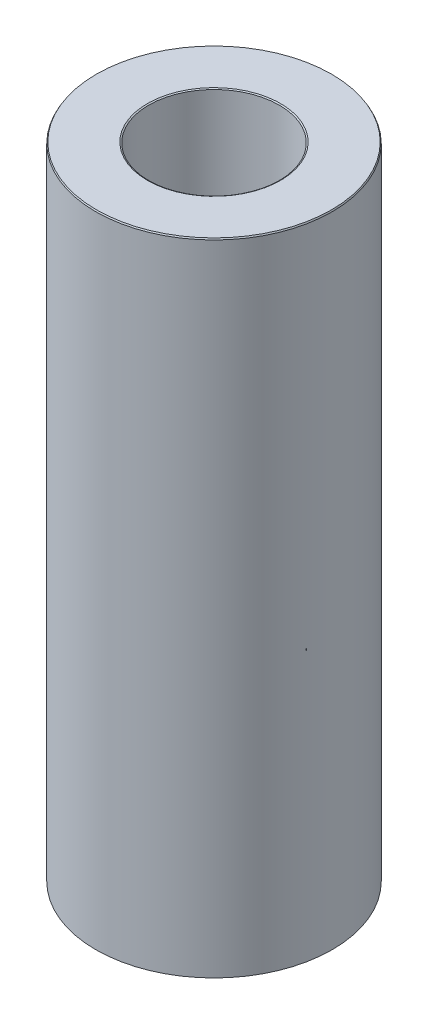
ISO-10303-21;
HEADER;
FILE_DESCRIPTION(('STEP AP214'),'2;1');
FILE_NAME('part.step','',(''),(''),'','','');
FILE_SCHEMA(('AUTOMOTIVE_DESIGN { 1 0 10303 214 1 1 1 1 }'));
ENDSEC;
DATA;
#1=APPLICATION_CONTEXT('core data for automotive mechanical design processes');
#2=APPLICATION_PROTOCOL_DEFINITION('international standard','automotive_design',2000,#1);
#3=PRODUCT_CONTEXT('',#1,'mechanical');
#4=PRODUCT('Part','Part','',(#3));
#5=PRODUCT_RELATED_PRODUCT_CATEGORY('part','',(#4));
#6=PRODUCT_DEFINITION_FORMATION('','',#4);
#7=PRODUCT_DEFINITION_CONTEXT('part definition',#1,'design');
#8=PRODUCT_DEFINITION('design','',#6,#7);
#9=PRODUCT_DEFINITION_SHAPE('','',#8);
#10=(LENGTH_UNIT() NAMED_UNIT(*) SI_UNIT(.MILLI.,.METRE.));
#11=(NAMED_UNIT(*) PLANE_ANGLE_UNIT() SI_UNIT($,.RADIAN.));
#12=(NAMED_UNIT(*) SI_UNIT($,.STERADIAN.) SOLID_ANGLE_UNIT());
#13=UNCERTAINTY_MEASURE_WITH_UNIT(LENGTH_MEASURE(1.E-05),#10,'distance_accuracy_value','');
#14=(GEOMETRIC_REPRESENTATION_CONTEXT(3) GLOBAL_UNCERTAINTY_ASSIGNED_CONTEXT((#13)) GLOBAL_UNIT_ASSIGNED_CONTEXT((#10,
#11,#12)) REPRESENTATION_CONTEXT('',''));
#15=CARTESIAN_POINT('',(0.,0.,0.));
#16=DIRECTION('',(0.,0.,1.));
#17=DIRECTION('',(1.,0.,0.));
#18=AXIS2_PLACEMENT_3D('',#15,#16,#17);
#19=CARTESIAN_POINT('',(0.,325.263457723034,0.));
#20=DIRECTION('',(0.,-1.,0.));
#21=DIRECTION('',(0.,0.,-1.));
#22=AXIS2_PLACEMENT_3D('',#19,#20,#21);
#23=CYLINDRICAL_SURFACE('',#22,60.);
#24=CARTESIAN_POINT('',(0.,0.372663856759436,0.));
#25=DIRECTION('',(0.,1.,0.));
#26=DIRECTION('',(0.,0.,1.));
#27=AXIS2_PLACEMENT_3D('',#24,#25,#26);
#28=CIRCLE('',#27,60.);
#29=CARTESIAN_POINT('',(0.,0.372663856759381,-60.));
#30=VERTEX_POINT('',#29);
#31=EDGE_CURVE('E10',#30,#30,#28,.T.);
#32=CARTESIAN_POINT('',(0.,324.617984988983,0.));
#33=DIRECTION('',(0.,1.,0.));
#34=DIRECTION('',(0.,0.,1.));
#35=AXIS2_PLACEMENT_3D('',#32,#33,#34);
#36=CIRCLE('',#35,60.);
#37=CARTESIAN_POINT('',(0.,324.617984988982,-60.));
#38=VERTEX_POINT('',#37);
#39=EDGE_CURVE('E50',#38,#38,#36,.F.);
#40=CARTESIAN_POINT('',(0.,0.372663856759381,-60.));
#41=CARTESIAN_POINT('',(0.,3.75021928522003,-60.));
#42=CARTESIAN_POINT('',(0.,7.12777471368068,-60.));
#43=CARTESIAN_POINT('',(0.,13.882885570602,-60.));
#44=CARTESIAN_POINT('',(0.,17.2604409990627,-60.));
#45=CARTESIAN_POINT('',(0.,24.015551855984,-60.));
#46=CARTESIAN_POINT('',(0.,27.3931072844446,-60.));
#47=CARTESIAN_POINT('',(0.,34.148218141366,-60.));
#48=CARTESIAN_POINT('',(0.,37.5257735698266,-60.));
#49=CARTESIAN_POINT('',(0.,44.280884426748,-60.));
#50=CARTESIAN_POINT('',(0.,47.6584398552086,-60.));
#51=CARTESIAN_POINT('',(0.,54.4135507121299,-60.));
#52=CARTESIAN_POINT('',(0.,57.7911061405906,-60.));
#53=CARTESIAN_POINT('',(0.,64.5462169975119,-60.));
#54=CARTESIAN_POINT('',(0.,67.9237724259725,-60.));
#55=CARTESIAN_POINT('',(0.,74.6788832828939,-60.));
#56=CARTESIAN_POINT('',(0.,78.0564387113545,-60.));
#57=CARTESIAN_POINT('',(0.,84.8115495682758,-60.));
#58=CARTESIAN_POINT('',(0.,88.1891049967365,-60.));
#59=CARTESIAN_POINT('',(0.,94.9442158536578,-60.));
#60=CARTESIAN_POINT('',(0.,98.3217712821184,-60.));
#61=CARTESIAN_POINT('',(0.,105.07688213904,-60.));
#62=CARTESIAN_POINT('',(0.,108.4544375675,-60.));
#63=CARTESIAN_POINT('',(0.,115.209548424422,-60.));
#64=CARTESIAN_POINT('',(0.,118.587103852882,-60.));
#65=CARTESIAN_POINT('',(0.,125.342214709804,-60.));
#66=CARTESIAN_POINT('',(0.,128.719770138264,-60.));
#67=CARTESIAN_POINT('',(0.,135.474880995186,-60.));
#68=CARTESIAN_POINT('',(0.,138.852436423646,-60.));
#69=CARTESIAN_POINT('',(0.,145.607547280568,-60.));
#70=CARTESIAN_POINT('',(0.,148.985102709028,-60.));
#71=CARTESIAN_POINT('',(0.,155.74021356595,-60.));
#72=CARTESIAN_POINT('',(0.,159.11776899441,-60.));
#73=CARTESIAN_POINT('',(0.,165.872879851332,-60.));
#74=CARTESIAN_POINT('',(0.,169.250435279792,-60.));
#75=CARTESIAN_POINT('',(0.,176.005546136714,-60.));
#76=CARTESIAN_POINT('',(0.,179.383101565174,-60.));
#77=CARTESIAN_POINT('',(0.,186.138212422096,-60.));
#78=CARTESIAN_POINT('',(0.,189.515767850556,-60.));
#79=CARTESIAN_POINT('',(0.,196.270878707477,-60.));
#80=CARTESIAN_POINT('',(0.,199.648434135938,-60.));
#81=CARTESIAN_POINT('',(0.,206.403544992859,-60.));
#82=CARTESIAN_POINT('',(0.,209.78110042132,-60.));
#83=CARTESIAN_POINT('',(0.,216.536211278241,-60.));
#84=CARTESIAN_POINT('',(0.,219.913766706702,-60.));
#85=CARTESIAN_POINT('',(0.,226.668877563623,-60.));
#86=CARTESIAN_POINT('',(0.,230.046432992084,-60.));
#87=CARTESIAN_POINT('',(0.,236.801543849005,-60.));
#88=CARTESIAN_POINT('',(0.,240.179099277466,-60.));
#89=CARTESIAN_POINT('',(0.,246.934210134387,-60.));
#90=CARTESIAN_POINT('',(0.,250.311765562848,-60.));
#91=CARTESIAN_POINT('',(0.,257.066876419769,-60.));
#92=CARTESIAN_POINT('',(0.,260.44443184823,-60.));
#93=CARTESIAN_POINT('',(0.,267.199542705151,-60.));
#94=CARTESIAN_POINT('',(0.,270.577098133612,-60.));
#95=CARTESIAN_POINT('',(0.,277.332208990533,-60.));
#96=CARTESIAN_POINT('',(0.,280.709764418994,-60.));
#97=CARTESIAN_POINT('',(0.,287.464875275915,-60.));
#98=CARTESIAN_POINT('',(0.,290.842430704376,-60.));
#99=CARTESIAN_POINT('',(0.,297.597541561297,-60.));
#100=CARTESIAN_POINT('',(0.,300.975096989758,-60.));
#101=CARTESIAN_POINT('',(0.,307.730207846679,-60.));
#102=CARTESIAN_POINT('',(0.,311.10776327514,-60.));
#103=CARTESIAN_POINT('',(0.,317.862874132061,-60.));
#104=CARTESIAN_POINT('',(0.,321.240429560522,-60.));
#105=CARTESIAN_POINT('',(0.,324.617984988982,-60.));
#106=B_SPLINE_CURVE_WITH_KNOTS('',3,(#40,#41,#42,#43,#44,#45,#46,#47,#48,#49,#50,#51,#52,#53,
#54,#55,#56,#57,#58,#59,#60,#61,#62,#63,#64,#65,#66,#67,#68,#69,#70,#71,#72,#73,#74,#75,#76,#77,
#78,#79,#80,#81,#82,#83,#84,#85,#86,#87,#88,#89,#90,#91,#92,#93,#94,#95,#96,#97,#98,#99,#100,
#101,#102,#103,#104,#105),.UNSPECIFIED.,.F.,.F.,(4,2,2,2,2,2,2,2,2,2,2,2,2,2,2,2,2,2,2,2,2,2,2,
2,2,2,2,2,2,2,2,2,4),(0.,10.132666285382,20.265332570764,30.3979988561459,40.5306651415279,
50.6633314269099,60.7959977122918,70.9286639976738,81.0613302830558,91.1939965684377,
101.32666285382,111.459329139202,121.591995424584,131.724661709966,141.857327995348,
151.98999428073,162.122660566112,172.255326851494,182.387993136876,192.520659422257,
202.653325707639,212.785991993021,222.918658278403,233.051324563785,243.183990849167,
253.316657134549,263.449323419931,273.581989705313,283.714655990695,293.847322276077,
303.979988561459,314.112654846841,324.245321132223),.UNSPECIFIED.);
#107=EDGE_CURVE('BSEAM39',#30,#38,#106,.T.);
#108=ORIENTED_EDGE('',*,*,#31,.T.);
#109=ORIENTED_EDGE('',*,*,#39,.T.);
#110=ORIENTED_EDGE('',*,*,#107,.T.);
#111=ORIENTED_EDGE('',*,*,#107,.F.);
#112=EDGE_LOOP('',(#108,#110,#109,#111));
#113=FACE_BOUND('',#112,.T.);
#114=ADVANCED_FACE('F39',(#113),#23,.T.);
#115=CARTESIAN_POINT('',(0.,325.263457723034,0.));
#116=DIRECTION('',(0.,1.,0.));
#117=DIRECTION('',(0.,0.,1.));
#118=AXIS2_PLACEMENT_3D('',#115,#116,#117);
#119=PLANE('',#118);
#120=CARTESIAN_POINT('',(0.,325.263457723034,0.));
#121=DIRECTION('',(0.,1.,0.));
#122=DIRECTION('',(0.,0.,1.));
#123=AXIS2_PLACEMENT_3D('',#120,#121,#122);
#124=CIRCLE('',#123,33.7817606473295);
#125=CARTESIAN_POINT('',(0.,325.263457723034,33.7817606473295));
#126=VERTEX_POINT('',#125);
#127=EDGE_CURVE('E58',#126,#126,#124,.F.);
#128=ORIENTED_EDGE('',*,*,#127,.T.);
#129=EDGE_LOOP('',(#128));
#130=FACE_BOUND('',#129,.T.);
#131=CARTESIAN_POINT('',(0.,325.263457723034,0.));
#132=DIRECTION('',(0.,1.,0.));
#133=DIRECTION('',(0.,0.,1.));
#134=AXIS2_PLACEMENT_3D('',#131,#132,#133);
#135=CIRCLE('',#134,59.6273361432409);
#136=CARTESIAN_POINT('',(0.,325.263457723034,59.6273361432409));
#137=VERTEX_POINT('',#136);
#138=EDGE_CURVE('E61',#137,#137,#135,.T.);
#139=ORIENTED_EDGE('',*,*,#138,.T.);
#140=EDGE_LOOP('',(#139));
#141=FACE_BOUND('',#140,.T.);
#142=ADVANCED_FACE('F88',(#130,#141),#119,.T.);
#143=CARTESIAN_POINT('',(0.,0.,0.));
#144=DIRECTION('',(0.,1.,0.));
#145=DIRECTION('',(0.,0.,1.));
#146=AXIS2_PLACEMENT_3D('',#143,#144,#145);
#147=PLANE('',#146);
#148=CARTESIAN_POINT('',(0.,0.,0.));
#149=DIRECTION('',(0.,1.,0.));
#150=DIRECTION('',(0.,0.,1.));
#151=AXIS2_PLACEMENT_3D('',#148,#149,#150);
#152=CIRCLE('',#151,33.5089517700369);
#153=CARTESIAN_POINT('',(0.,0.,33.5089517700369));
#154=VERTEX_POINT('',#153);
#155=EDGE_CURVE('E51',#154,#154,#152,.T.);
#156=ORIENTED_EDGE('',*,*,#155,.T.);
#157=EDGE_LOOP('',(#156));
#158=FACE_BOUND('',#157,.T.);
#159=CARTESIAN_POINT('',(0.,0.,0.));
#160=DIRECTION('',(0.,1.,0.));
#161=DIRECTION('',(0.,0.,1.));
#162=AXIS2_PLACEMENT_3D('',#159,#160,#161);
#163=CIRCLE('',#162,59.354527265948);
#164=CARTESIAN_POINT('',(0.,0.,59.354527265948));
#165=VERTEX_POINT('',#164);
#166=EDGE_CURVE('E54',#165,#165,#163,.F.);
#167=ORIENTED_EDGE('',*,*,#166,.T.);
#168=EDGE_LOOP('',(#167));
#169=FACE_BOUND('',#168,.T.);
#170=ADVANCED_FACE('F83',(#158,#169),#147,.F.);
#171=CARTESIAN_POINT('',(0.,325.263457723034,0.));
#172=DIRECTION('',(0.,-1.,0.));
#173=DIRECTION('',(0.,0.,-1.));
#174=AXIS2_PLACEMENT_3D('',#171,#172,#173);
#175=CYLINDRICAL_SURFACE('',#174,33.1362879132775);
#176=CARTESIAN_POINT('',(0.,324.890793866275,0.));
#177=DIRECTION('',(0.,1.,0.));
#178=DIRECTION('',(0.,0.,1.));
#179=AXIS2_PLACEMENT_3D('',#176,#177,#178);
#180=CIRCLE('',#179,33.1362879132775);
#181=CARTESIAN_POINT('',(0.,324.890793866274,-33.1362879132775));
#182=VERTEX_POINT('',#181);
#183=EDGE_CURVE('E67',#182,#182,#180,.T.);
#184=CARTESIAN_POINT('',(0.,0.645472734051855,0.));
#185=DIRECTION('',(0.,1.,0.));
#186=DIRECTION('',(0.,0.,1.));
#187=AXIS2_PLACEMENT_3D('',#184,#185,#186);
#188=CIRCLE('',#187,33.1362879132775);
#189=CARTESIAN_POINT('',(0.,0.6454727340518,-33.1362879132775));
#190=VERTEX_POINT('',#189);
#191=EDGE_CURVE('E69',#190,#190,#188,.F.);
#192=CARTESIAN_POINT('',(0.,324.890793866274,-33.1362879132775));
#193=CARTESIAN_POINT('',(0.,321.513238437814,-33.1362879132775));
#194=CARTESIAN_POINT('',(0.,318.135683009353,-33.1362879132775));
#195=CARTESIAN_POINT('',(0.,311.380572152432,-33.1362879132775));
#196=CARTESIAN_POINT('',(0.,308.003016723971,-33.1362879132775));
#197=CARTESIAN_POINT('',(0.,301.24790586705,-33.1362879132775));
#198=CARTESIAN_POINT('',(0.,297.870350438589,-33.1362879132775));
#199=CARTESIAN_POINT('',(0.,291.115239581668,-33.1362879132775));
#200=CARTESIAN_POINT('',(0.,287.737684153207,-33.1362879132775));
#201=CARTESIAN_POINT('',(0.,280.982573296286,-33.1362879132775));
#202=CARTESIAN_POINT('',(0.,277.605017867825,-33.1362879132775));
#203=CARTESIAN_POINT('',(0.,270.849907010904,-33.1362879132775));
#204=CARTESIAN_POINT('',(0.,267.472351582443,-33.1362879132775));
#205=CARTESIAN_POINT('',(0.,260.717240725522,-33.1362879132775));
#206=CARTESIAN_POINT('',(0.,257.339685297061,-33.1362879132775));
#207=CARTESIAN_POINT('',(0.,250.58457444014,-33.1362879132775));
#208=CARTESIAN_POINT('',(0.,247.207019011679,-33.1362879132775));
#209=CARTESIAN_POINT('',(0.,240.451908154758,-33.1362879132775));
#210=CARTESIAN_POINT('',(0.,237.074352726298,-33.1362879132775));
#211=CARTESIAN_POINT('',(0.,230.319241869376,-33.1362879132775));
#212=CARTESIAN_POINT('',(0.,226.941686440916,-33.1362879132775));
#213=CARTESIAN_POINT('',(0.,220.186575583994,-33.1362879132775));
#214=CARTESIAN_POINT('',(0.,216.809020155534,-33.1362879132775));
#215=CARTESIAN_POINT('',(0.,210.053909298612,-33.1362879132775));
#216=CARTESIAN_POINT('',(0.,206.676353870152,-33.1362879132775));
#217=CARTESIAN_POINT('',(0.,199.92124301323,-33.1362879132775));
#218=CARTESIAN_POINT('',(0.,196.54368758477,-33.1362879132775));
#219=CARTESIAN_POINT('',(0.,189.788576727848,-33.1362879132775));
#220=CARTESIAN_POINT('',(0.,186.411021299388,-33.1362879132775));
#221=CARTESIAN_POINT('',(0.,179.655910442466,-33.1362879132775));
#222=CARTESIAN_POINT('',(0.,176.278355014006,-33.1362879132775));
#223=CARTESIAN_POINT('',(0.,169.523244157084,-33.1362879132775));
#224=CARTESIAN_POINT('',(0.,166.145688728624,-33.1362879132775));
#225=CARTESIAN_POINT('',(0.,159.390577871703,-33.1362879132775));
#226=CARTESIAN_POINT('',(0.,156.013022443242,-33.1362879132775));
#227=CARTESIAN_POINT('',(0.,149.257911586321,-33.1362879132775));
#228=CARTESIAN_POINT('',(0.,145.88035615786,-33.1362879132775));
#229=CARTESIAN_POINT('',(0.,139.125245300939,-33.1362879132775));
#230=CARTESIAN_POINT('',(0.,135.747689872478,-33.1362879132775));
#231=CARTESIAN_POINT('',(0.,128.992579015557,-33.1362879132775));
#232=CARTESIAN_POINT('',(0.,125.615023587096,-33.1362879132775));
#233=CARTESIAN_POINT('',(0.,118.859912730175,-33.1362879132775));
#234=CARTESIAN_POINT('',(0.,115.482357301714,-33.1362879132775));
#235=CARTESIAN_POINT('',(0.,108.727246444793,-33.1362879132775));
#236=CARTESIAN_POINT('',(0.,105.349691016332,-33.1362879132775));
#237=CARTESIAN_POINT('',(0.,98.5945801594107,-33.1362879132775));
#238=CARTESIAN_POINT('',(0.,95.2170247309501,-33.1362879132775));
#239=CARTESIAN_POINT('',(0.,88.4619138740288,-33.1362879132775));
#240=CARTESIAN_POINT('',(0.,85.0843584455681,-33.1362879132775));
#241=CARTESIAN_POINT('',(0.,78.3292475886468,-33.1362879132775));
#242=CARTESIAN_POINT('',(0.,74.9516921601862,-33.1362879132775));
#243=CARTESIAN_POINT('',(0.,68.1965813032649,-33.1362879132775));
#244=CARTESIAN_POINT('',(0.,64.8190258748042,-33.1362879132775));
#245=CARTESIAN_POINT('',(0.,58.0639150178829,-33.1362879132775));
#246=CARTESIAN_POINT('',(0.,54.6863595894223,-33.1362879132775));
#247=CARTESIAN_POINT('',(0.,47.931248732501,-33.1362879132775));
#248=CARTESIAN_POINT('',(0.,44.5536933040403,-33.1362879132775));
#249=CARTESIAN_POINT('',(0.,37.798582447119,-33.1362879132775));
#250=CARTESIAN_POINT('',(0.,34.4210270186583,-33.1362879132775));
#251=CARTESIAN_POINT('',(0.,27.665916161737,-33.1362879132775));
#252=CARTESIAN_POINT('',(0.,24.2883607332764,-33.1362879132775));
#253=CARTESIAN_POINT('',(0.,17.5332498763551,-33.1362879132775));
#254=CARTESIAN_POINT('',(0.,14.1556944478944,-33.1362879132775));
#255=CARTESIAN_POINT('',(0.,7.4005835909731,-33.1362879132775));
#256=CARTESIAN_POINT('',(0.,4.02302816251245,-33.1362879132775));
#257=CARTESIAN_POINT('',(0.,0.6454727340518,-33.1362879132775));
#258=B_SPLINE_CURVE_WITH_KNOTS('',3,(#192,#193,#194,#195,#196,#197,#198,#199,#200,#201,#202,
#203,#204,#205,#206,#207,#208,#209,#210,#211,#212,#213,#214,#215,#216,#217,#218,#219,#220,#221,
#222,#223,#224,#225,#226,#227,#228,#229,#230,#231,#232,#233,#234,#235,#236,#237,#238,#239,#240,
#241,#242,#243,#244,#245,#246,#247,#248,#249,#250,#251,#252,#253,#254,#255,#256,#257),
.UNSPECIFIED.,.F.,.F.,(4,2,2,2,2,2,2,2,2,2,2,2,2,2,2,2,2,2,2,2,2,2,2,2,2,2,2,2,2,2,2,2,4),(0.,
10.132666285382,20.2653325707639,30.3979988561459,40.5306651415278,50.6633314269098,
60.7959977122917,70.9286639976737,81.0613302830556,91.1939965684376,101.32666285382,
111.459329139202,121.591995424583,131.724661709965,141.857327995347,151.989994280729,
162.122660566111,172.255326851493,182.387993136875,192.520659422257,202.653325707639,
212.785991993021,222.918658278403,233.051324563785,243.183990849167,253.316657134549,
263.449323419931,273.581989705313,283.714655990695,293.847322276077,303.979988561459,
314.112654846841,324.245321132223),.UNSPECIFIED.);
#259=EDGE_CURVE('BSEAM71',#182,#190,#258,.T.);
#260=ORIENTED_EDGE('',*,*,#183,.T.);
#261=ORIENTED_EDGE('',*,*,#191,.T.);
#262=ORIENTED_EDGE('',*,*,#259,.T.);
#263=ORIENTED_EDGE('',*,*,#259,.F.);
#264=EDGE_LOOP('',(#260,#262,#261,#263));
#265=FACE_BOUND('',#264,.T.);
#266=ADVANCED_FACE('F71',(#265),#175,.F.);
#267=CARTESIAN_POINT('',(0.,324.890793866275,0.));
#268=DIRECTION('',(0.,1.,0.));
#269=DIRECTION('',(0.,0.,1.));
#270=AXIS2_PLACEMENT_3D('',#267,#268,#269);
#271=CONICAL_SURFACE('',#270,33.1362879132775,1.04719755119662);
#272=ORIENTED_EDGE('',*,*,#127,.F.);
#273=EDGE_LOOP('',(#272));
#274=FACE_BOUND('',#273,.T.);
#275=ORIENTED_EDGE('',*,*,#183,.F.);
#276=EDGE_LOOP('',(#275));
#277=FACE_BOUND('',#276,.T.);
#278=ADVANCED_FACE('F77',(#274,#277),#271,.F.);
#279=CARTESIAN_POINT('',(0.,0.,0.));
#280=DIRECTION('',(0.,-1.,0.));
#281=DIRECTION('',(0.,0.,-1.));
#282=AXIS2_PLACEMENT_3D('',#279,#280,#281);
#283=CONICAL_SURFACE('',#282,33.5089517700369,0.523598775598314);
#284=ORIENTED_EDGE('',*,*,#191,.F.);
#285=EDGE_LOOP('',(#284));
#286=FACE_BOUND('',#285,.T.);
#287=ORIENTED_EDGE('',*,*,#155,.F.);
#288=EDGE_LOOP('',(#287));
#289=FACE_BOUND('',#288,.T.);
#290=ADVANCED_FACE('F73',(#286,#289),#283,.F.);
#291=CARTESIAN_POINT('',(0.,0.372663856759436,0.));
#292=DIRECTION('',(0.,1.,0.));
#293=DIRECTION('',(0.,0.,1.));
#294=AXIS2_PLACEMENT_3D('',#291,#292,#293);
#295=CONICAL_SURFACE('',#294,60.,1.04719755119667);
#296=ORIENTED_EDGE('',*,*,#166,.F.);
#297=EDGE_LOOP('',(#296));
#298=FACE_BOUND('',#297,.T.);
#299=ORIENTED_EDGE('',*,*,#31,.F.);
#300=EDGE_LOOP('',(#299));
#301=FACE_BOUND('',#300,.T.);
#302=ADVANCED_FACE('F76',(#298,#301),#295,.T.);
#303=CARTESIAN_POINT('',(0.,325.263457723034,0.));
#304=DIRECTION('',(0.,-1.,0.));
#305=DIRECTION('',(0.,0.,-1.));
#306=AXIS2_PLACEMENT_3D('',#303,#304,#305);
#307=CONICAL_SURFACE('',#306,59.6273361432409,0.523598775598258);
#308=ORIENTED_EDGE('',*,*,#39,.F.);
#309=EDGE_LOOP('',(#308));
#310=FACE_BOUND('',#309,.T.);
#311=ORIENTED_EDGE('',*,*,#138,.F.);
#312=EDGE_LOOP('',(#311));
#313=FACE_BOUND('',#312,.T.);
#314=ADVANCED_FACE('F45',(#310,#313),#307,.T.);
#315=CLOSED_SHELL('',(#114,#142,#170,#266,#278,#290,#302,#314));
#316=MANIFOLD_SOLID_BREP('B2',#315);
#317=ADVANCED_BREP_SHAPE_REPRESENTATION('',(#18,#316),#14);
#318=SHAPE_DEFINITION_REPRESENTATION(#9,#317);
ENDSEC;
END-ISO-10303-21;
